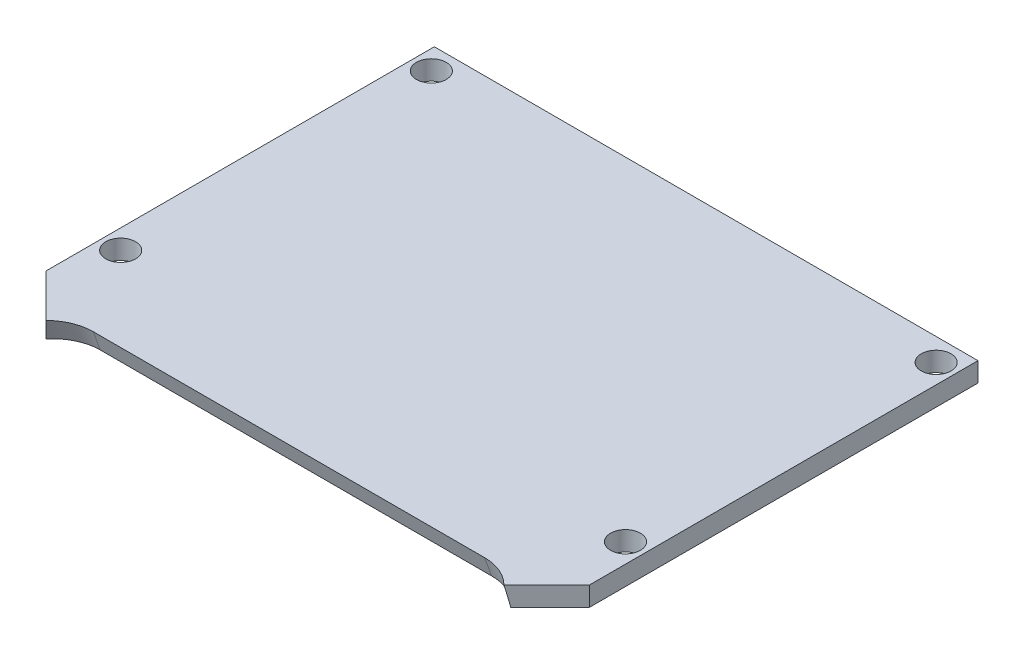
ISO-10303-21;
HEADER;
FILE_DESCRIPTION(('STEP AP214'),'2;1');
FILE_NAME('part.step','',(''),(''),'','','');
FILE_SCHEMA(('AUTOMOTIVE_DESIGN { 1 0 10303 214 1 1 1 1 }'));
ENDSEC;
DATA;
#1=APPLICATION_CONTEXT('core data for automotive mechanical design processes');
#2=APPLICATION_PROTOCOL_DEFINITION('international standard','automotive_design',2000,#1);
#3=PRODUCT_CONTEXT('',#1,'mechanical');
#4=PRODUCT('Part','Part','',(#3));
#5=PRODUCT_RELATED_PRODUCT_CATEGORY('part','',(#4));
#6=PRODUCT_DEFINITION_FORMATION('','',#4);
#7=PRODUCT_DEFINITION_CONTEXT('part definition',#1,'design');
#8=PRODUCT_DEFINITION('design','',#6,#7);
#9=PRODUCT_DEFINITION_SHAPE('','',#8);
#10=(LENGTH_UNIT() NAMED_UNIT(*) SI_UNIT(.MILLI.,.METRE.));
#11=(NAMED_UNIT(*) PLANE_ANGLE_UNIT() SI_UNIT($,.RADIAN.));
#12=(NAMED_UNIT(*) SI_UNIT($,.STERADIAN.) SOLID_ANGLE_UNIT());
#13=UNCERTAINTY_MEASURE_WITH_UNIT(LENGTH_MEASURE(1.E-05),#10,'distance_accuracy_value','');
#14=(GEOMETRIC_REPRESENTATION_CONTEXT(3) GLOBAL_UNCERTAINTY_ASSIGNED_CONTEXT((#13)) GLOBAL_UNIT_ASSIGNED_CONTEXT((#10,
#11,#12)) REPRESENTATION_CONTEXT('',''));
#15=CARTESIAN_POINT('',(0.,0.,0.));
#16=DIRECTION('',(0.,0.,1.));
#17=DIRECTION('',(1.,0.,0.));
#18=AXIS2_PLACEMENT_3D('',#15,#16,#17);
#19=CARTESIAN_POINT('',(0.,1.5875,0.));
#20=DIRECTION('',(0.,1.,0.));
#21=DIRECTION('',(0.,0.,1.));
#22=AXIS2_PLACEMENT_3D('',#19,#20,#21);
#23=PLANE('',#22);
#24=CARTESIAN_POINT('',(20.6375,1.58750000000001,-4.51612015150079));
#25=DIRECTION('',(0.,1.,0.));
#26=DIRECTION('',(0.,0.,1.));
#27=AXIS2_PLACEMENT_3D('',#24,#25,#26);
#28=CIRCLE('',#27,1.21919999999999);
#29=CARTESIAN_POINT('',(20.6375,1.58750000000001,-3.2969201515008));
#30=VERTEX_POINT('',#29);
#31=EDGE_CURVE('E322',#30,#30,#28,.T.);
#32=ORIENTED_EDGE('',*,*,#31,.F.);
#33=EDGE_LOOP('',(#32));
#34=FACE_BOUND('',#33,.T.);
#35=CARTESIAN_POINT('',(20.6375,1.58750000000001,-29.9161201515008));
#36=DIRECTION('',(0.,1.,0.));
#37=DIRECTION('',(0.,0.,1.));
#38=AXIS2_PLACEMENT_3D('',#35,#36,#37);
#39=CIRCLE('',#38,1.21919999999999);
#40=CARTESIAN_POINT('',(20.6375,1.58750000000001,-28.6969201515008));
#41=VERTEX_POINT('',#40);
#42=EDGE_CURVE('E324',#41,#41,#39,.T.);
#43=ORIENTED_EDGE('',*,*,#42,.F.);
#44=EDGE_LOOP('',(#43));
#45=FACE_BOUND('',#44,.T.);
#46=CARTESIAN_POINT('',(-20.6375,1.58750000000001,-29.9161201515008));
#47=DIRECTION('',(0.,1.,0.));
#48=DIRECTION('',(0.,0.,1.));
#49=AXIS2_PLACEMENT_3D('',#46,#47,#48);
#50=CIRCLE('',#49,1.21919999999999);
#51=CARTESIAN_POINT('',(-20.6375,1.58750000000001,-28.6969201515008));
#52=VERTEX_POINT('',#51);
#53=EDGE_CURVE('E332',#52,#52,#50,.T.);
#54=ORIENTED_EDGE('',*,*,#53,.F.);
#55=EDGE_LOOP('',(#54));
#56=FACE_BOUND('',#55,.T.);
#57=CARTESIAN_POINT('',(-20.6375,1.58750000000001,-4.51612015150079));
#58=DIRECTION('',(0.,1.,0.));
#59=DIRECTION('',(0.,0.,1.));
#60=AXIS2_PLACEMENT_3D('',#57,#58,#59);
#61=CIRCLE('',#60,1.21919999999999);
#62=CARTESIAN_POINT('',(-20.6375,1.58750000000001,-3.2969201515008));
#63=VERTEX_POINT('',#62);
#64=EDGE_CURVE('E338',#63,#63,#61,.T.);
#65=ORIENTED_EDGE('',*,*,#64,.F.);
#66=EDGE_LOOP('',(#65));
#67=FACE_BOUND('',#66,.T.);
#68=DIRECTION('',(1.,0.,0.));
#69=VECTOR('',#68,1.);
#70=CARTESIAN_POINT('',(0.,1.5875,2.36779554375898));
#71=LINE('',#70,#69);
#72=CARTESIAN_POINT('',(-16.0000000000001,1.5875,2.367795543759));
#73=VERTEX_POINT('',#72);
#74=CARTESIAN_POINT('',(16.,1.58750000000001,2.36779554375896));
#75=VERTEX_POINT('',#74);
#76=EDGE_CURVE('E122',#73,#75,#71,.T.);
#77=ORIENTED_EDGE('',*,*,#76,.T.);
#78=CARTESIAN_POINT('',(16.,1.5875,6.62450663366264));
#79=DIRECTION('',(0.,1.,0.));
#80=DIRECTION('',(0.,0.,-1.));
#81=AXIS2_PLACEMENT_3D('',#78,#79,#80);
#82=ELLIPSE('',#81,4.25671108990369,4.00000000000003);
#83=CARTESIAN_POINT('',(18.7207877826992,1.5875,3.50421221730078));
#84=VERTEX_POINT('',#83);
#85=EDGE_CURVE('E143',#75,#84,#82,.F.);
#86=ORIENTED_EDGE('',*,*,#85,.T.);
#87=DIRECTION('',(0.707106781186548,0.,-0.707106781186548));
#88=VECTOR('',#87,1.);
#89=CARTESIAN_POINT('',(0.,1.5875,22.225));
#90=LINE('',#89,#88);
#91=CARTESIAN_POINT('',(22.225,1.5875,0.));
#92=VERTEX_POINT('',#91);
#93=EDGE_CURVE('E149',#84,#92,#90,.T.);
#94=ORIENTED_EDGE('',*,*,#93,.T.);
#95=DIRECTION('',(0.,0.,-1.));
#96=VECTOR('',#95,1.);
#97=CARTESIAN_POINT('',(22.225,1.5875,-31.75));
#98=LINE('',#97,#96);
#99=CARTESIAN_POINT('',(22.225,1.5875,-31.75));
#100=VERTEX_POINT('',#99);
#101=EDGE_CURVE('E151',#92,#100,#98,.T.);
#102=ORIENTED_EDGE('',*,*,#101,.T.);
#103=DIRECTION('',(-1.,0.,0.));
#104=VECTOR('',#103,1.);
#105=CARTESIAN_POINT('',(-22.225,1.5875,-31.75));
#106=LINE('',#105,#104);
#107=CARTESIAN_POINT('',(-22.225,1.5875,-31.75));
#108=VERTEX_POINT('',#107);
#109=EDGE_CURVE('E71',#100,#108,#106,.T.);
#110=ORIENTED_EDGE('',*,*,#109,.T.);
#111=DIRECTION('',(0.,0.,1.));
#112=VECTOR('',#111,1.);
#113=CARTESIAN_POINT('',(-22.225,1.5875,-31.75));
#114=LINE('',#113,#112);
#115=CARTESIAN_POINT('',(-22.225,1.5875,0.));
#116=VERTEX_POINT('',#115);
#117=EDGE_CURVE('E146',#108,#116,#114,.T.);
#118=ORIENTED_EDGE('',*,*,#117,.T.);
#119=DIRECTION('',(0.707106781186548,0.,0.707106781186547));
#120=VECTOR('',#119,1.);
#121=CARTESIAN_POINT('',(-22.225,1.5875,0.));
#122=LINE('',#121,#120);
#123=CARTESIAN_POINT('',(-18.7207877826992,1.5875,3.50421221730078));
#124=VERTEX_POINT('',#123);
#125=EDGE_CURVE('E99',#116,#124,#122,.T.);
#126=ORIENTED_EDGE('',*,*,#125,.T.);
#127=CARTESIAN_POINT('',(-16.0000000000001,1.5875,6.62450663366263));
#128=DIRECTION('',(0.,1.,0.));
#129=DIRECTION('',(0.,0.,-1.));
#130=AXIS2_PLACEMENT_3D('',#127,#128,#129);
#131=ELLIPSE('',#130,4.25671108990363,3.99999999999998);
#132=EDGE_CURVE('E132',#124,#73,#131,.F.);
#133=ORIENTED_EDGE('',*,*,#132,.T.);
#134=EDGE_LOOP('',(#77,#86,#94,#102,#110,#118,#126,#133));
#135=FACE_BOUND('',#134,.T.);
#136=ADVANCED_FACE('F47',(#34,#45,#56,#67,#135),#23,.T.);
#137=CARTESIAN_POINT('',(-22.225,1.5875,-31.75));
#138=DIRECTION('',(1.,0.,0.));
#139=DIRECTION('',(0.,0.,-1.));
#140=AXIS2_PLACEMENT_3D('',#137,#138,#139);
#141=PLANE('',#140);
#142=DIRECTION('',(0.,0.,1.));
#143=VECTOR('',#142,1.);
#144=CARTESIAN_POINT('',(-22.225,0.,-31.75));
#145=LINE('',#144,#143);
#146=CARTESIAN_POINT('',(-22.225,0.,-31.75));
#147=VERTEX_POINT('',#146);
#148=CARTESIAN_POINT('',(-22.225,0.,0.));
#149=VERTEX_POINT('',#148);
#150=EDGE_CURVE('E145',#147,#149,#145,.T.);
#151=ORIENTED_EDGE('',*,*,#150,.T.);
#152=DIRECTION('',(0.,-1.,0.));
#153=VECTOR('',#152,1.);
#154=CARTESIAN_POINT('',(-22.225,1.5875,0.));
#155=LINE('',#154,#153);
#156=EDGE_CURVE('E171',#116,#149,#155,.T.);
#157=ORIENTED_EDGE('',*,*,#156,.F.);
#158=ORIENTED_EDGE('',*,*,#117,.F.);
#159=DIRECTION('',(0.,-1.,0.));
#160=VECTOR('',#159,1.);
#161=CARTESIAN_POINT('',(-22.225,1.5875,-31.75));
#162=LINE('',#161,#160);
#163=EDGE_CURVE('E154',#108,#147,#162,.T.);
#164=ORIENTED_EDGE('',*,*,#163,.T.);
#165=EDGE_LOOP('',(#151,#157,#158,#164));
#166=FACE_BOUND('',#165,.T.);
#167=ADVANCED_FACE('F49',(#166),#141,.F.);
#168=CARTESIAN_POINT('',(-22.225,1.5875,0.));
#169=DIRECTION('',(0.707106781186547,0.,-0.707106781186548));
#170=DIRECTION('',(-0.707106781186548,0.,-0.707106781186547));
#171=AXIS2_PLACEMENT_3D('',#168,#169,#170);
#172=PLANE('',#171);
#173=CARTESIAN_POINT('',(-16.0000000000001,0.48986454508938,6.22499999999993));
#174=DIRECTION('',(0.707106781186547,0.,-0.707106781186548));
#175=DIRECTION('',(-0.176241818064392,-0.968440830991091,-0.176241818064392));
#176=AXIS2_PLACEMENT_3D('',#173,#174,#175);
#177=ELLIPSE('',#176,16.539535345747,3.99999999999998);
#178=CARTESIAN_POINT('',(-18.9972094869002,0.,3.22779051309977));
#179=VERTEX_POINT('',#178);
#180=EDGE_CURVE('E62',#124,#179,#177,.F.);
#181=ORIENTED_EDGE('',*,*,#180,.F.);
#182=ORIENTED_EDGE('',*,*,#125,.F.);
#183=ORIENTED_EDGE('',*,*,#156,.T.);
#184=DIRECTION('',(0.707106781186548,0.,0.707106781186547));
#185=VECTOR('',#184,1.);
#186=CARTESIAN_POINT('',(-22.225,0.,0.));
#187=LINE('',#186,#185);
#188=EDGE_CURVE('E157',#149,#179,#187,.T.);
#189=ORIENTED_EDGE('',*,*,#188,.T.);
#190=EDGE_LOOP('',(#181,#182,#183,#189));
#191=FACE_BOUND('',#190,.T.);
#192=ADVANCED_FACE('F194',(#191),#172,.F.);
#193=CARTESIAN_POINT('',(0.,1.5875,22.225));
#194=DIRECTION('',(-0.707106781186548,0.,-0.707106781186548));
#195=DIRECTION('',(-0.707106781186548,0.,0.707106781186548));
#196=AXIS2_PLACEMENT_3D('',#193,#194,#195);
#197=PLANE('',#196);
#198=CARTESIAN_POINT('',(16.,0.489864545089461,6.22499999999997));
#199=DIRECTION('',(-0.707106781186548,0.,-0.707106781186548));
#200=DIRECTION('',(0.176241818064391,-0.968440830991092,-0.176241818064391));
#201=AXIS2_PLACEMENT_3D('',#198,#199,#200);
#202=ELLIPSE('',#201,16.5395353457471,4.00000000000003);
#203=CARTESIAN_POINT('',(18.9972094869002,0.,3.22779051309977));
#204=VERTEX_POINT('',#203);
#205=EDGE_CURVE('E131',#204,#84,#202,.F.);
#206=ORIENTED_EDGE('',*,*,#205,.F.);
#207=DIRECTION('',(0.707106781186548,0.,-0.707106781186548));
#208=VECTOR('',#207,1.);
#209=CARTESIAN_POINT('',(0.,0.,22.225));
#210=LINE('',#209,#208);
#211=CARTESIAN_POINT('',(22.225,0.,0.));
#212=VERTEX_POINT('',#211);
#213=EDGE_CURVE('E160',#204,#212,#210,.T.);
#214=ORIENTED_EDGE('',*,*,#213,.T.);
#215=DIRECTION('',(0.,-1.,0.));
#216=VECTOR('',#215,1.);
#217=CARTESIAN_POINT('',(22.225,1.5875,0.));
#218=LINE('',#217,#216);
#219=EDGE_CURVE('E168',#92,#212,#218,.T.);
#220=ORIENTED_EDGE('',*,*,#219,.F.);
#221=ORIENTED_EDGE('',*,*,#93,.F.);
#222=EDGE_LOOP('',(#206,#214,#220,#221));
#223=FACE_BOUND('',#222,.T.);
#224=ADVANCED_FACE('F183',(#223),#197,.F.);
#225=CARTESIAN_POINT('',(22.225,1.5875,-31.75));
#226=DIRECTION('',(-1.,0.,0.));
#227=DIRECTION('',(0.,0.,1.));
#228=AXIS2_PLACEMENT_3D('',#225,#226,#227);
#229=PLANE('',#228);
#230=DIRECTION('',(0.,0.,-1.));
#231=VECTOR('',#230,1.);
#232=CARTESIAN_POINT('',(22.225,0.,-31.75));
#233=LINE('',#232,#231);
#234=CARTESIAN_POINT('',(22.225,0.,-31.75));
#235=VERTEX_POINT('',#234);
#236=EDGE_CURVE('E162',#212,#235,#233,.T.);
#237=ORIENTED_EDGE('',*,*,#236,.T.);
#238=DIRECTION('',(0.,-1.,0.));
#239=VECTOR('',#238,1.);
#240=CARTESIAN_POINT('',(22.225,1.5875,-31.75));
#241=LINE('',#240,#239);
#242=EDGE_CURVE('E166',#100,#235,#241,.T.);
#243=ORIENTED_EDGE('',*,*,#242,.F.);
#244=ORIENTED_EDGE('',*,*,#101,.F.);
#245=ORIENTED_EDGE('',*,*,#219,.T.);
#246=EDGE_LOOP('',(#237,#243,#244,#245));
#247=FACE_BOUND('',#246,.T.);
#248=ADVANCED_FACE('F187',(#247),#229,.F.);
#249=CARTESIAN_POINT('',(-22.225,1.5875,-31.75));
#250=DIRECTION('',(0.,0.,1.));
#251=DIRECTION('',(1.,0.,0.));
#252=AXIS2_PLACEMENT_3D('',#249,#250,#251);
#253=PLANE('',#252);
#254=DIRECTION('',(-1.,0.,0.));
#255=VECTOR('',#254,1.);
#256=CARTESIAN_POINT('',(-22.225,0.,-31.75));
#257=LINE('',#256,#255);
#258=EDGE_CURVE('E92',#235,#147,#257,.T.);
#259=ORIENTED_EDGE('',*,*,#258,.T.);
#260=ORIENTED_EDGE('',*,*,#163,.F.);
#261=ORIENTED_EDGE('',*,*,#109,.F.);
#262=ORIENTED_EDGE('',*,*,#242,.T.);
#263=EDGE_LOOP('',(#259,#260,#261,#262));
#264=FACE_BOUND('',#263,.T.);
#265=ADVANCED_FACE('F189',(#264),#253,.F.);
#266=CARTESIAN_POINT('',(0.,0.,0.));
#267=DIRECTION('',(0.,1.,0.));
#268=DIRECTION('',(0.,0.,1.));
#269=AXIS2_PLACEMENT_3D('',#266,#267,#268);
#270=PLANE('',#269);
#271=CARTESIAN_POINT('',(20.6375,0.,-4.51612015150079));
#272=DIRECTION('',(0.,1.,0.));
#273=DIRECTION('',(0.,0.,1.));
#274=AXIS2_PLACEMENT_3D('',#271,#272,#273);
#275=CIRCLE('',#274,1.2192);
#276=CARTESIAN_POINT('',(20.6375,0.,-3.2969201515008));
#277=VERTEX_POINT('',#276);
#278=EDGE_CURVE('E320',#277,#277,#275,.T.);
#279=ORIENTED_EDGE('',*,*,#278,.T.);
#280=EDGE_LOOP('',(#279));
#281=FACE_BOUND('',#280,.T.);
#282=CARTESIAN_POINT('',(20.6375,0.,-29.9161201515008));
#283=DIRECTION('',(0.,1.,0.));
#284=DIRECTION('',(0.,0.,1.));
#285=AXIS2_PLACEMENT_3D('',#282,#283,#284);
#286=CIRCLE('',#285,1.2192);
#287=CARTESIAN_POINT('',(20.6375,0.,-28.6969201515008));
#288=VERTEX_POINT('',#287);
#289=EDGE_CURVE('E329',#288,#288,#286,.T.);
#290=ORIENTED_EDGE('',*,*,#289,.T.);
#291=EDGE_LOOP('',(#290));
#292=FACE_BOUND('',#291,.T.);
#293=CARTESIAN_POINT('',(-20.6375,0.,-29.9161201515008));
#294=DIRECTION('',(0.,1.,0.));
#295=DIRECTION('',(0.,0.,1.));
#296=AXIS2_PLACEMENT_3D('',#293,#294,#295);
#297=CIRCLE('',#296,1.2192);
#298=CARTESIAN_POINT('',(-20.6375,0.,-28.6969201515008));
#299=VERTEX_POINT('',#298);
#300=EDGE_CURVE('E335',#299,#299,#297,.T.);
#301=ORIENTED_EDGE('',*,*,#300,.T.);
#302=EDGE_LOOP('',(#301));
#303=FACE_BOUND('',#302,.T.);
#304=CARTESIAN_POINT('',(-20.6375,0.,-4.51612015150079));
#305=DIRECTION('',(0.,1.,0.));
#306=DIRECTION('',(0.,0.,1.));
#307=AXIS2_PLACEMENT_3D('',#304,#305,#306);
#308=CIRCLE('',#307,1.2192);
#309=CARTESIAN_POINT('',(-20.6375,0.,-3.2969201515008));
#310=VERTEX_POINT('',#309);
#311=EDGE_CURVE('E136',#310,#310,#308,.T.);
#312=ORIENTED_EDGE('',*,*,#311,.T.);
#313=EDGE_LOOP('',(#312));
#314=FACE_BOUND('',#313,.T.);
#315=CARTESIAN_POINT('',(16.,0.,6.04670388676505));
#316=DIRECTION('',(0.,1.,0.));
#317=DIRECTION('',(0.,0.,-1.));
#318=AXIS2_PLACEMENT_3D('',#315,#316,#317);
#319=ELLIPSE('',#318,4.25671108990369,4.00000000000003);
#320=CARTESIAN_POINT('',(16.,0.,1.78999279686136));
#321=VERTEX_POINT('',#320);
#322=EDGE_CURVE('E13',#321,#204,#319,.F.);
#323=ORIENTED_EDGE('',*,*,#322,.F.);
#324=DIRECTION('',(1.,0.,0.));
#325=VECTOR('',#324,1.);
#326=CARTESIAN_POINT('',(0.,0.,1.78999279686138));
#327=LINE('',#326,#325);
#328=CARTESIAN_POINT('',(-16.0000000000001,0.,1.78999279686141));
#329=VERTEX_POINT('',#328);
#330=EDGE_CURVE('E55',#329,#321,#327,.T.);
#331=ORIENTED_EDGE('',*,*,#330,.F.);
#332=CARTESIAN_POINT('',(-16.0000000000001,0.,6.04670388676504));
#333=DIRECTION('',(0.,1.,0.));
#334=DIRECTION('',(0.,0.,-1.));
#335=AXIS2_PLACEMENT_3D('',#332,#333,#334);
#336=ELLIPSE('',#335,4.25671108990363,3.99999999999998);
#337=EDGE_CURVE('E135',#179,#329,#336,.F.);
#338=ORIENTED_EDGE('',*,*,#337,.F.);
#339=ORIENTED_EDGE('',*,*,#188,.F.);
#340=ORIENTED_EDGE('',*,*,#150,.F.);
#341=ORIENTED_EDGE('',*,*,#258,.F.);
#342=ORIENTED_EDGE('',*,*,#236,.F.);
#343=ORIENTED_EDGE('',*,*,#213,.F.);
#344=EDGE_LOOP('',(#323,#331,#338,#339,#340,#341,#342,#343));
#345=FACE_BOUND('',#344,.T.);
#346=ADVANCED_FACE('F179',(#281,#292,#303,#314,#345),#270,.F.);
#347=CARTESIAN_POINT('',(16.,6.60140192043937,8.44941769023273));
#348=DIRECTION('',(0.,-0.939692620785908,-0.342020143325669));
#349=DIRECTION('',(0.,0.342020143325669,-0.939692620785908));
#350=AXIS2_PLACEMENT_3D('',#347,#348,#349);
#351=CYLINDRICAL_SURFACE('',#350,4.00000000000003);
#352=DIRECTION('',(0.,-0.939692620785908,-0.342020143325669));
#353=VECTOR('',#352,1.);
#354=CARTESIAN_POINT('',(16.0000000000001,7.96948249374206,4.69064720708906));
#355=LINE('',#354,#353);
#356=EDGE_CURVE('E128',#75,#321,#355,.T.);
#357=ORIENTED_EDGE('',*,*,#356,.T.);
#358=ORIENTED_EDGE('',*,*,#322,.T.);
#359=ORIENTED_EDGE('',*,*,#205,.T.);
#360=ORIENTED_EDGE('',*,*,#85,.F.);
#361=EDGE_LOOP('',(#357,#358,#359,#360));
#362=FACE_BOUND('',#361,.T.);
#363=ADVANCED_FACE('F176',(#362),#351,.F.);
#364=CARTESIAN_POINT('',(16.0000000000001,7.96948249374206,4.69064720708906));
#365=DIRECTION('',(0.,-0.342020143325669,0.939692620785908));
#366=DIRECTION('',(0.,-0.939692620785908,-0.342020143325669));
#367=AXIS2_PLACEMENT_3D('',#364,#365,#366);
#368=PLANE('',#367);
#369=DIRECTION('',(0.,-0.939692620785908,-0.342020143325669));
#370=VECTOR('',#369,1.);
#371=CARTESIAN_POINT('',(-16.0000000000001,7.96948249374207,4.69064720708911));
#372=LINE('',#371,#370);
#373=EDGE_CURVE('E125',#73,#329,#372,.T.);
#374=ORIENTED_EDGE('',*,*,#373,.T.);
#375=ORIENTED_EDGE('',*,*,#330,.T.);
#376=ORIENTED_EDGE('',*,*,#356,.F.);
#377=ORIENTED_EDGE('',*,*,#76,.F.);
#378=EDGE_LOOP('',(#374,#375,#376,#377));
#379=FACE_BOUND('',#378,.T.);
#380=ADVANCED_FACE('F124',(#379),#368,.T.);
#381=CARTESIAN_POINT('',(-16.0000000000001,6.6014019204394,8.44941769023273));
#382=DIRECTION('',(0.,-0.939692620785908,-0.342020143325669));
#383=DIRECTION('',(0.,0.342020143325669,-0.939692620785908));
#384=AXIS2_PLACEMENT_3D('',#381,#382,#383);
#385=CYLINDRICAL_SURFACE('',#384,3.99999999999998);
#386=ORIENTED_EDGE('',*,*,#180,.T.);
#387=ORIENTED_EDGE('',*,*,#337,.T.);
#388=ORIENTED_EDGE('',*,*,#373,.F.);
#389=ORIENTED_EDGE('',*,*,#132,.F.);
#390=EDGE_LOOP('',(#386,#387,#388,#389));
#391=FACE_BOUND('',#390,.T.);
#392=ADVANCED_FACE('F134',(#391),#385,.F.);
#393=CARTESIAN_POINT('',(-20.6375,1.58750000000001,-4.51612015150079));
#394=DIRECTION('',(0.,1.,0.));
#395=DIRECTION('',(0.,0.,1.));
#396=AXIS2_PLACEMENT_3D('',#393,#394,#395);
#397=CYLINDRICAL_SURFACE('',#396,1.21919999999999);
#398=ORIENTED_EDGE('',*,*,#311,.F.);
#399=EDGE_LOOP('',(#398));
#400=FACE_BOUND('',#399,.T.);
#401=ORIENTED_EDGE('',*,*,#64,.T.);
#402=EDGE_LOOP('',(#401));
#403=FACE_BOUND('',#402,.T.);
#404=ADVANCED_FACE('F250',(#400,#403),#397,.F.);
#405=CARTESIAN_POINT('',(-20.6375,1.58750000000001,-29.9161201515008));
#406=DIRECTION('',(0.,1.,0.));
#407=DIRECTION('',(0.,0.,1.));
#408=AXIS2_PLACEMENT_3D('',#405,#406,#407);
#409=CYLINDRICAL_SURFACE('',#408,1.21919999999999);
#410=ORIENTED_EDGE('',*,*,#300,.F.);
#411=EDGE_LOOP('',(#410));
#412=FACE_BOUND('',#411,.T.);
#413=ORIENTED_EDGE('',*,*,#53,.T.);
#414=EDGE_LOOP('',(#413));
#415=FACE_BOUND('',#414,.T.);
#416=ADVANCED_FACE('F256',(#412,#415),#409,.F.);
#417=CARTESIAN_POINT('',(20.6375,1.58750000000001,-29.9161201515008));
#418=DIRECTION('',(0.,1.,0.));
#419=DIRECTION('',(0.,0.,1.));
#420=AXIS2_PLACEMENT_3D('',#417,#418,#419);
#421=CYLINDRICAL_SURFACE('',#420,1.21919999999999);
#422=ORIENTED_EDGE('',*,*,#289,.F.);
#423=EDGE_LOOP('',(#422));
#424=FACE_BOUND('',#423,.T.);
#425=ORIENTED_EDGE('',*,*,#42,.T.);
#426=EDGE_LOOP('',(#425));
#427=FACE_BOUND('',#426,.T.);
#428=ADVANCED_FACE('F264',(#424,#427),#421,.F.);
#429=CARTESIAN_POINT('',(20.6375,1.58750000000001,-4.51612015150079));
#430=DIRECTION('',(0.,1.,0.));
#431=DIRECTION('',(0.,0.,1.));
#432=AXIS2_PLACEMENT_3D('',#429,#430,#431);
#433=CYLINDRICAL_SURFACE('',#432,1.21919999999999);
#434=ORIENTED_EDGE('',*,*,#278,.F.);
#435=EDGE_LOOP('',(#434));
#436=FACE_BOUND('',#435,.T.);
#437=ORIENTED_EDGE('',*,*,#31,.T.);
#438=EDGE_LOOP('',(#437));
#439=FACE_BOUND('',#438,.T.);
#440=ADVANCED_FACE('F272',(#436,#439),#433,.F.);
#441=CLOSED_SHELL('',(#136,#167,#192,#224,#248,#265,#346,#363,#380,#392,#404,#416,#428,#440));
#442=MANIFOLD_SOLID_BREP('B2',#441);
#443=ADVANCED_BREP_SHAPE_REPRESENTATION('',(#18,#442),#14);
#444=SHAPE_DEFINITION_REPRESENTATION(#9,#443);
ENDSEC;
END-ISO-10303-21;
